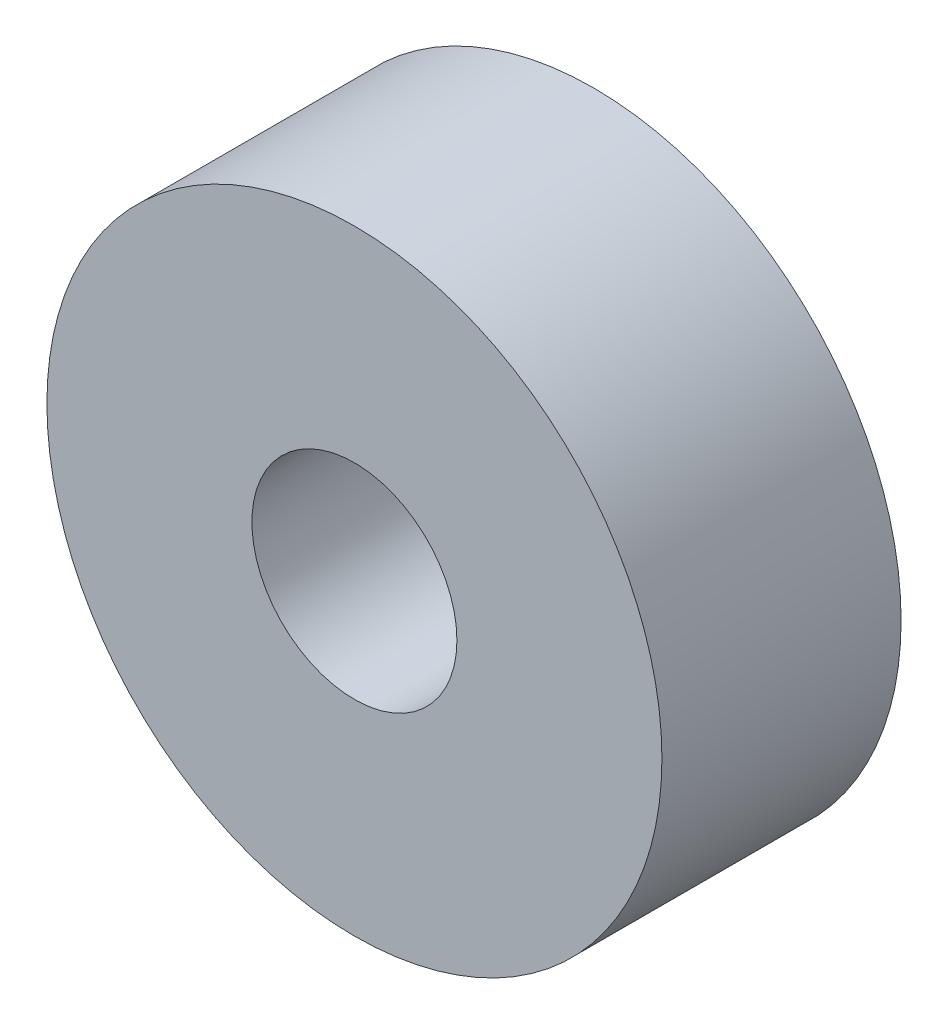
ISO-10303-21;
HEADER;
FILE_DESCRIPTION(('STEP AP214'),'2;1');
FILE_NAME('part.step','',(''),(''),'','','');
FILE_SCHEMA(('AUTOMOTIVE_DESIGN { 1 0 10303 214 1 1 1 1 }'));
ENDSEC;
DATA;
#1=APPLICATION_CONTEXT('core data for automotive mechanical design processes');
#2=APPLICATION_PROTOCOL_DEFINITION('international standard','automotive_design',2000,#1);
#3=PRODUCT_CONTEXT('',#1,'mechanical');
#4=PRODUCT('Part','Part','',(#3));
#5=PRODUCT_RELATED_PRODUCT_CATEGORY('part','',(#4));
#6=PRODUCT_DEFINITION_FORMATION('','',#4);
#7=PRODUCT_DEFINITION_CONTEXT('part definition',#1,'design');
#8=PRODUCT_DEFINITION('design','',#6,#7);
#9=PRODUCT_DEFINITION_SHAPE('','',#8);
#10=(LENGTH_UNIT() NAMED_UNIT(*) SI_UNIT(.MILLI.,.METRE.));
#11=(NAMED_UNIT(*) PLANE_ANGLE_UNIT() SI_UNIT($,.RADIAN.));
#12=(NAMED_UNIT(*) SI_UNIT($,.STERADIAN.) SOLID_ANGLE_UNIT());
#13=UNCERTAINTY_MEASURE_WITH_UNIT(LENGTH_MEASURE(1.E-05),#10,'distance_accuracy_value','');
#14=(GEOMETRIC_REPRESENTATION_CONTEXT(3) GLOBAL_UNCERTAINTY_ASSIGNED_CONTEXT((#13)) GLOBAL_UNIT_ASSIGNED_CONTEXT((#10,
#11,#12)) REPRESENTATION_CONTEXT('',''));
#15=CARTESIAN_POINT('',(0.,0.,0.));
#16=DIRECTION('',(0.,0.,1.));
#17=DIRECTION('',(1.,0.,0.));
#18=AXIS2_PLACEMENT_3D('',#15,#16,#17);
#19=CARTESIAN_POINT('',(0.,0.,7.));
#20=DIRECTION('',(0.,0.,1.));
#21=DIRECTION('',(1.,0.,0.));
#22=AXIS2_PLACEMENT_3D('',#19,#20,#21);
#23=PLANE('',#22);
#24=CARTESIAN_POINT('',(0.,0.,7.));
#25=DIRECTION('',(0.,0.,1.));
#26=DIRECTION('',(1.,0.,0.));
#27=AXIS2_PLACEMENT_3D('',#24,#25,#26);
#28=CIRCLE('',#27,9.);
#29=CARTESIAN_POINT('',(9.,0.,7.));
#30=VERTEX_POINT('',#29);
#31=EDGE_CURVE('E10',#30,#30,#28,.T.);
#32=ORIENTED_EDGE('',*,*,#31,.T.);
#33=EDGE_LOOP('',(#32));
#34=FACE_BOUND('',#33,.T.);
#35=CARTESIAN_POINT('',(0.,0.,7.));
#36=DIRECTION('',(0.,0.,1.));
#37=DIRECTION('',(1.,0.,0.));
#38=AXIS2_PLACEMENT_3D('',#35,#36,#37);
#39=CIRCLE('',#38,3.);
#40=CARTESIAN_POINT('',(3.,0.,7.));
#41=VERTEX_POINT('',#40);
#42=EDGE_CURVE('E54',#41,#41,#39,.T.);
#43=ORIENTED_EDGE('',*,*,#42,.F.);
#44=EDGE_LOOP('',(#43));
#45=FACE_BOUND('',#44,.T.);
#46=ADVANCED_FACE('F41',(#34,#45),#23,.T.);
#47=CARTESIAN_POINT('',(0.,0.,0.));
#48=DIRECTION('',(0.,0.,1.));
#49=DIRECTION('',(1.,0.,0.));
#50=AXIS2_PLACEMENT_3D('',#47,#48,#49);
#51=PLANE('',#50);
#52=CARTESIAN_POINT('',(0.,0.,0.));
#53=DIRECTION('',(0.,0.,1.));
#54=DIRECTION('',(1.,0.,0.));
#55=AXIS2_PLACEMENT_3D('',#52,#53,#54);
#56=CIRCLE('',#55,9.);
#57=CARTESIAN_POINT('',(9.,0.,0.));
#58=VERTEX_POINT('',#57);
#59=EDGE_CURVE('E45',#58,#58,#56,.T.);
#60=ORIENTED_EDGE('',*,*,#59,.F.);
#61=EDGE_LOOP('',(#60));
#62=FACE_BOUND('',#61,.T.);
#63=CARTESIAN_POINT('',(0.,0.,0.));
#64=DIRECTION('',(0.,0.,1.));
#65=DIRECTION('',(1.,0.,0.));
#66=AXIS2_PLACEMENT_3D('',#63,#64,#65);
#67=CIRCLE('',#66,3.);
#68=CARTESIAN_POINT('',(3.,0.,0.));
#69=VERTEX_POINT('',#68);
#70=EDGE_CURVE('E56',#69,#69,#67,.T.);
#71=ORIENTED_EDGE('',*,*,#70,.T.);
#72=EDGE_LOOP('',(#71));
#73=FACE_BOUND('',#72,.T.);
#74=ADVANCED_FACE('F68',(#62,#73),#51,.F.);
#75=CARTESIAN_POINT('',(0.,0.,7.));
#76=DIRECTION('',(0.,0.,-1.));
#77=DIRECTION('',(-1.,0.,0.));
#78=AXIS2_PLACEMENT_3D('',#75,#76,#77);
#79=CYLINDRICAL_SURFACE('',#78,9.);
#80=ORIENTED_EDGE('',*,*,#31,.F.);
#81=EDGE_LOOP('',(#80));
#82=FACE_BOUND('',#81,.T.);
#83=ORIENTED_EDGE('',*,*,#59,.T.);
#84=EDGE_LOOP('',(#83));
#85=FACE_BOUND('',#84,.T.);
#86=ADVANCED_FACE('F43',(#82,#85),#79,.T.);
#87=CARTESIAN_POINT('',(0.,0.,7.));
#88=DIRECTION('',(0.,0.,-1.));
#89=DIRECTION('',(-1.,0.,0.));
#90=AXIS2_PLACEMENT_3D('',#87,#88,#89);
#91=CYLINDRICAL_SURFACE('',#90,3.);
#92=ORIENTED_EDGE('',*,*,#42,.T.);
#93=EDGE_LOOP('',(#92));
#94=FACE_BOUND('',#93,.T.);
#95=ORIENTED_EDGE('',*,*,#70,.F.);
#96=EDGE_LOOP('',(#95));
#97=FACE_BOUND('',#96,.T.);
#98=ADVANCED_FACE('F64',(#94,#97),#91,.F.);
#99=CLOSED_SHELL('',(#46,#74,#86,#98));
#100=MANIFOLD_SOLID_BREP('B2',#99);
#101=ADVANCED_BREP_SHAPE_REPRESENTATION('',(#18,#100),#14);
#102=SHAPE_DEFINITION_REPRESENTATION(#9,#101);
ENDSEC;
END-ISO-10303-21;
